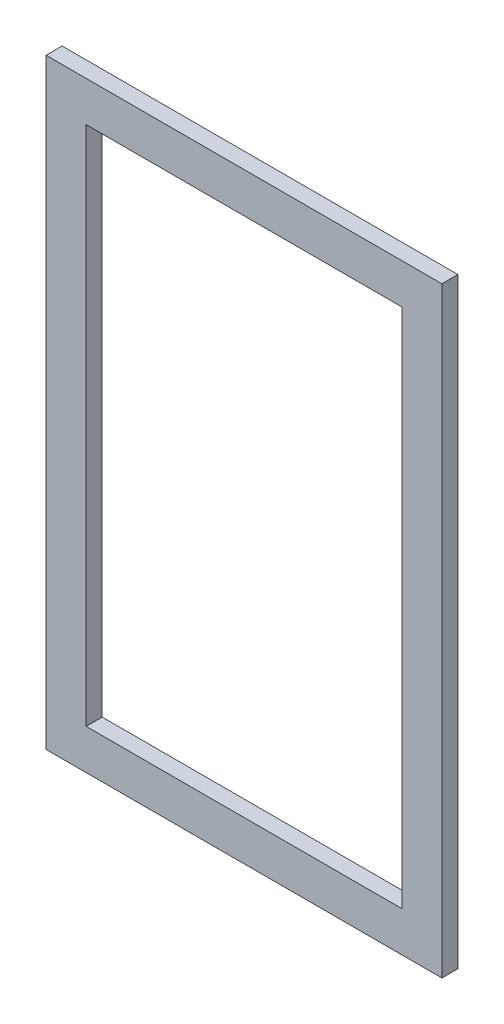
ISO-10303-21;
HEADER;
FILE_DESCRIPTION(('STEP AP214'),'2;1');
FILE_NAME('part.step','',(''),(''),'','','');
FILE_SCHEMA(('AUTOMOTIVE_DESIGN { 1 0 10303 214 1 1 1 1 }'));
ENDSEC;
DATA;
#1=APPLICATION_CONTEXT('core data for automotive mechanical design processes');
#2=APPLICATION_PROTOCOL_DEFINITION('international standard','automotive_design',2000,#1);
#3=PRODUCT_CONTEXT('',#1,'mechanical');
#4=PRODUCT('Part','Part','',(#3));
#5=PRODUCT_RELATED_PRODUCT_CATEGORY('part','',(#4));
#6=PRODUCT_DEFINITION_FORMATION('','',#4);
#7=PRODUCT_DEFINITION_CONTEXT('part definition',#1,'design');
#8=PRODUCT_DEFINITION('design','',#6,#7);
#9=PRODUCT_DEFINITION_SHAPE('','',#8);
#10=(LENGTH_UNIT() NAMED_UNIT(*) SI_UNIT(.MILLI.,.METRE.));
#11=(NAMED_UNIT(*) PLANE_ANGLE_UNIT() SI_UNIT($,.RADIAN.));
#12=(NAMED_UNIT(*) SI_UNIT($,.STERADIAN.) SOLID_ANGLE_UNIT());
#13=UNCERTAINTY_MEASURE_WITH_UNIT(LENGTH_MEASURE(1.E-05),#10,'distance_accuracy_value','');
#14=(GEOMETRIC_REPRESENTATION_CONTEXT(3) GLOBAL_UNCERTAINTY_ASSIGNED_CONTEXT((#13)) GLOBAL_UNIT_ASSIGNED_CONTEXT((#10,
#11,#12)) REPRESENTATION_CONTEXT('',''));
#15=CARTESIAN_POINT('',(0.,0.,0.));
#16=DIRECTION('',(0.,0.,1.));
#17=DIRECTION('',(1.,0.,0.));
#18=AXIS2_PLACEMENT_3D('',#15,#16,#17);
#19=CARTESIAN_POINT('',(-335.008892233003,-208.54308280627,334.460719179294));
#20=DIRECTION('',(1.,0.,0.));
#21=DIRECTION('',(0.,0.,-1.));
#22=AXIS2_PLACEMENT_3D('',#19,#20,#21);
#23=PLANE('',#22);
#24=DIRECTION('',(0.,-1.,0.));
#25=VECTOR('',#24,1.);
#26=CARTESIAN_POINT('',(-335.008892233003,-208.54308280627,318.460719179294));
#27=LINE('',#26,#25);
#28=CARTESIAN_POINT('',(-335.008892233003,391.45691719373,318.460719179294));
#29=VERTEX_POINT('',#28);
#30=CARTESIAN_POINT('',(-335.008892233003,-208.54308280627,318.460719179294));
#31=VERTEX_POINT('',#30);
#32=EDGE_CURVE('E130',#29,#31,#27,.T.);
#33=ORIENTED_EDGE('',*,*,#32,.T.);
#34=DIRECTION('',(0.,0.,-1.));
#35=VECTOR('',#34,1.);
#36=CARTESIAN_POINT('',(-335.008892233003,-208.54308280627,334.460719179294));
#37=LINE('',#36,#35);
#38=CARTESIAN_POINT('',(-335.008892233003,-208.54308280627,334.460719179294));
#39=VERTEX_POINT('',#38);
#40=EDGE_CURVE('E11',#39,#31,#37,.T.);
#41=ORIENTED_EDGE('',*,*,#40,.F.);
#42=DIRECTION('',(0.,-1.,0.));
#43=VECTOR('',#42,1.);
#44=CARTESIAN_POINT('',(-335.008892233003,-208.54308280627,334.460719179294));
#45=LINE('',#44,#43);
#46=CARTESIAN_POINT('',(-335.008892233003,391.45691719373,334.460719179294));
#47=VERTEX_POINT('',#46);
#48=EDGE_CURVE('E134',#47,#39,#45,.T.);
#49=ORIENTED_EDGE('',*,*,#48,.F.);
#50=DIRECTION('',(0.,0.,-1.));
#51=VECTOR('',#50,1.);
#52=CARTESIAN_POINT('',(-335.008892233003,391.45691719373,334.460719179294));
#53=LINE('',#52,#51);
#54=EDGE_CURVE('E144',#47,#29,#53,.T.);
#55=ORIENTED_EDGE('',*,*,#54,.T.);
#56=EDGE_LOOP('',(#33,#41,#49,#55));
#57=FACE_BOUND('',#56,.T.);
#58=ADVANCED_FACE('F33',(#57),#23,.F.);
#59=CARTESIAN_POINT('',(-335.008892233003,-208.54308280627,334.460719179294));
#60=DIRECTION('',(0.,1.,0.));
#61=DIRECTION('',(0.,0.,1.));
#62=AXIS2_PLACEMENT_3D('',#59,#60,#61);
#63=PLANE('',#62);
#64=DIRECTION('',(1.,0.,0.));
#65=VECTOR('',#64,1.);
#66=CARTESIAN_POINT('',(-335.008892233003,-208.54308280627,318.460719179294));
#67=LINE('',#66,#65);
#68=CARTESIAN_POINT('',(59.9911077669972,-208.54308280627,318.460719179294));
#69=VERTEX_POINT('',#68);
#70=EDGE_CURVE('E147',#31,#69,#67,.T.);
#71=ORIENTED_EDGE('',*,*,#70,.T.);
#72=DIRECTION('',(0.,0.,-1.));
#73=VECTOR('',#72,1.);
#74=CARTESIAN_POINT('',(59.9911077669972,-208.54308280627,334.460719179294));
#75=LINE('',#74,#73);
#76=CARTESIAN_POINT('',(59.9911077669972,-208.54308280627,334.460719179294));
#77=VERTEX_POINT('',#76);
#78=EDGE_CURVE('E40',#77,#69,#75,.T.);
#79=ORIENTED_EDGE('',*,*,#78,.F.);
#80=DIRECTION('',(1.,0.,0.));
#81=VECTOR('',#80,1.);
#82=CARTESIAN_POINT('',(-335.008892233003,-208.54308280627,334.460719179294));
#83=LINE('',#82,#81);
#84=EDGE_CURVE('E137',#39,#77,#83,.T.);
#85=ORIENTED_EDGE('',*,*,#84,.F.);
#86=ORIENTED_EDGE('',*,*,#40,.T.);
#87=EDGE_LOOP('',(#71,#79,#85,#86));
#88=FACE_BOUND('',#87,.T.);
#89=ADVANCED_FACE('F175',(#88),#63,.F.);
#90=CARTESIAN_POINT('',(59.9911077669972,-208.54308280627,334.460719179294));
#91=DIRECTION('',(-1.,0.,0.));
#92=DIRECTION('',(0.,0.,1.));
#93=AXIS2_PLACEMENT_3D('',#90,#91,#92);
#94=PLANE('',#93);
#95=DIRECTION('',(0.,1.,0.));
#96=VECTOR('',#95,1.);
#97=CARTESIAN_POINT('',(59.9911077669972,-208.54308280627,318.460719179294));
#98=LINE('',#97,#96);
#99=CARTESIAN_POINT('',(59.9911077669972,391.45691719373,318.460719179294));
#100=VERTEX_POINT('',#99);
#101=EDGE_CURVE('E149',#69,#100,#98,.T.);
#102=ORIENTED_EDGE('',*,*,#101,.T.);
#103=DIRECTION('',(0.,0.,-1.));
#104=VECTOR('',#103,1.);
#105=CARTESIAN_POINT('',(59.9911077669972,391.45691719373,334.460719179294));
#106=LINE('',#105,#104);
#107=CARTESIAN_POINT('',(59.9911077669972,391.45691719373,334.460719179294));
#108=VERTEX_POINT('',#107);
#109=EDGE_CURVE('E154',#108,#100,#106,.T.);
#110=ORIENTED_EDGE('',*,*,#109,.F.);
#111=DIRECTION('',(0.,1.,0.));
#112=VECTOR('',#111,1.);
#113=CARTESIAN_POINT('',(59.9911077669972,-208.54308280627,334.460719179294));
#114=LINE('',#113,#112);
#115=EDGE_CURVE('E140',#77,#108,#114,.T.);
#116=ORIENTED_EDGE('',*,*,#115,.F.);
#117=ORIENTED_EDGE('',*,*,#78,.T.);
#118=EDGE_LOOP('',(#102,#110,#116,#117));
#119=FACE_BOUND('',#118,.T.);
#120=ADVANCED_FACE('F161',(#119),#94,.F.);
#121=CARTESIAN_POINT('',(-335.008892233003,391.45691719373,334.460719179294));
#122=DIRECTION('',(0.,-1.,0.));
#123=DIRECTION('',(0.,0.,-1.));
#124=AXIS2_PLACEMENT_3D('',#121,#122,#123);
#125=PLANE('',#124);
#126=DIRECTION('',(-1.,0.,0.));
#127=VECTOR('',#126,1.);
#128=CARTESIAN_POINT('',(-335.008892233003,391.45691719373,318.460719179294));
#129=LINE('',#128,#127);
#130=EDGE_CURVE('E138',#100,#29,#129,.T.);
#131=ORIENTED_EDGE('',*,*,#130,.T.);
#132=ORIENTED_EDGE('',*,*,#54,.F.);
#133=DIRECTION('',(-1.,0.,0.));
#134=VECTOR('',#133,1.);
#135=CARTESIAN_POINT('',(-335.008892233003,391.45691719373,334.460719179294));
#136=LINE('',#135,#134);
#137=EDGE_CURVE('E142',#108,#47,#136,.T.);
#138=ORIENTED_EDGE('',*,*,#137,.F.);
#139=ORIENTED_EDGE('',*,*,#109,.T.);
#140=EDGE_LOOP('',(#131,#132,#138,#139));
#141=FACE_BOUND('',#140,.T.);
#142=ADVANCED_FACE('F168',(#141),#125,.F.);
#143=CARTESIAN_POINT('',(-335.008892233003,-208.54308280627,334.460719179294));
#144=DIRECTION('',(0.,0.,-1.));
#145=DIRECTION('',(-1.,0.,0.));
#146=AXIS2_PLACEMENT_3D('',#143,#144,#145);
#147=PLANE('',#146);
#148=DIRECTION('',(1.,0.,0.));
#149=VECTOR('',#148,1.);
#150=CARTESIAN_POINT('',(-295.008892233003,-168.54308280627,334.460719179294));
#151=LINE('',#150,#149);
#152=CARTESIAN_POINT('',(-295.008892233003,-168.54308280627,334.460719179294));
#153=VERTEX_POINT('',#152);
#154=CARTESIAN_POINT('',(19.9911077669974,-168.54308280627,334.460719179294));
#155=VERTEX_POINT('',#154);
#156=EDGE_CURVE('E124',#153,#155,#151,.T.);
#157=ORIENTED_EDGE('',*,*,#156,.F.);
#158=DIRECTION('',(0.,-1.,0.));
#159=VECTOR('',#158,1.);
#160=CARTESIAN_POINT('',(-295.008892233003,351.45691719373,334.460719179294));
#161=LINE('',#160,#159);
#162=CARTESIAN_POINT('',(-295.008892233003,351.45691719373,334.460719179294));
#163=VERTEX_POINT('',#162);
#164=EDGE_CURVE('E47',#163,#153,#161,.T.);
#165=ORIENTED_EDGE('',*,*,#164,.F.);
#166=DIRECTION('',(-1.,0.,0.));
#167=VECTOR('',#166,1.);
#168=CARTESIAN_POINT('',(-295.008892233003,351.45691719373,334.460719179294));
#169=LINE('',#168,#167);
#170=CARTESIAN_POINT('',(19.9911077669973,351.45691719373,334.460719179294));
#171=VERTEX_POINT('',#170);
#172=EDGE_CURVE('E115',#171,#163,#169,.T.);
#173=ORIENTED_EDGE('',*,*,#172,.F.);
#174=DIRECTION('',(0.,1.,0.));
#175=VECTOR('',#174,1.);
#176=CARTESIAN_POINT('',(19.9911077669973,351.45691719373,334.460719179294));
#177=LINE('',#176,#175);
#178=EDGE_CURVE('E118',#155,#171,#177,.T.);
#179=ORIENTED_EDGE('',*,*,#178,.F.);
#180=EDGE_LOOP('',(#157,#165,#173,#179));
#181=FACE_BOUND('',#180,.T.);
#182=ORIENTED_EDGE('',*,*,#48,.T.);
#183=ORIENTED_EDGE('',*,*,#84,.T.);
#184=ORIENTED_EDGE('',*,*,#115,.T.);
#185=ORIENTED_EDGE('',*,*,#137,.T.);
#186=EDGE_LOOP('',(#182,#183,#184,#185));
#187=FACE_BOUND('',#186,.T.);
#188=ADVANCED_FACE('F174',(#181,#187),#147,.F.);
#189=CARTESIAN_POINT('',(-335.008892233003,-208.54308280627,318.460719179294));
#190=DIRECTION('',(0.,0.,-1.));
#191=DIRECTION('',(-1.,0.,0.));
#192=AXIS2_PLACEMENT_3D('',#189,#190,#191);
#193=PLANE('',#192);
#194=DIRECTION('',(0.,-1.,0.));
#195=VECTOR('',#194,1.);
#196=CARTESIAN_POINT('',(-295.008892233003,351.45691719373,318.460719179294));
#197=LINE('',#196,#195);
#198=CARTESIAN_POINT('',(-295.008892233003,351.45691719373,318.460719179294));
#199=VERTEX_POINT('',#198);
#200=CARTESIAN_POINT('',(-295.008892233003,-168.54308280627,318.460719179294));
#201=VERTEX_POINT('',#200);
#202=EDGE_CURVE('E99',#199,#201,#197,.T.);
#203=ORIENTED_EDGE('',*,*,#202,.T.);
#204=DIRECTION('',(1.,0.,0.));
#205=VECTOR('',#204,1.);
#206=CARTESIAN_POINT('',(-295.008892233003,-168.54308280627,318.460719179294));
#207=LINE('',#206,#205);
#208=CARTESIAN_POINT('',(19.9911077669974,-168.54308280627,318.460719179294));
#209=VERTEX_POINT('',#208);
#210=EDGE_CURVE('E108',#201,#209,#207,.T.);
#211=ORIENTED_EDGE('',*,*,#210,.T.);
#212=DIRECTION('',(0.,1.,0.));
#213=VECTOR('',#212,1.);
#214=CARTESIAN_POINT('',(19.9911077669973,351.45691719373,318.460719179294));
#215=LINE('',#214,#213);
#216=CARTESIAN_POINT('',(19.9911077669973,351.45691719373,318.460719179294));
#217=VERTEX_POINT('',#216);
#218=EDGE_CURVE('E55',#209,#217,#215,.T.);
#219=ORIENTED_EDGE('',*,*,#218,.T.);
#220=DIRECTION('',(-1.,0.,0.));
#221=VECTOR('',#220,1.);
#222=CARTESIAN_POINT('',(-295.008892233003,351.45691719373,318.460719179294));
#223=LINE('',#222,#221);
#224=EDGE_CURVE('E105',#217,#199,#223,.T.);
#225=ORIENTED_EDGE('',*,*,#224,.T.);
#226=EDGE_LOOP('',(#203,#211,#219,#225));
#227=FACE_BOUND('',#226,.T.);
#228=ORIENTED_EDGE('',*,*,#32,.F.);
#229=ORIENTED_EDGE('',*,*,#130,.F.);
#230=ORIENTED_EDGE('',*,*,#101,.F.);
#231=ORIENTED_EDGE('',*,*,#70,.F.);
#232=EDGE_LOOP('',(#228,#229,#230,#231));
#233=FACE_BOUND('',#232,.T.);
#234=ADVANCED_FACE('F112',(#227,#233),#193,.T.);
#235=CARTESIAN_POINT('',(-295.008892233003,351.45691719373,318.460719179294));
#236=DIRECTION('',(-1.,0.,0.));
#237=DIRECTION('',(0.,-1.,0.));
#238=AXIS2_PLACEMENT_3D('',#235,#236,#237);
#239=PLANE('',#238);
#240=ORIENTED_EDGE('',*,*,#164,.T.);
#241=DIRECTION('',(0.,0.,1.));
#242=VECTOR('',#241,1.);
#243=CARTESIAN_POINT('',(-295.008892233003,-168.54308280627,318.460719179294));
#244=LINE('',#243,#242);
#245=EDGE_CURVE('E95',#201,#153,#244,.T.);
#246=ORIENTED_EDGE('',*,*,#245,.F.);
#247=ORIENTED_EDGE('',*,*,#202,.F.);
#248=DIRECTION('',(0.,0.,1.));
#249=VECTOR('',#248,1.);
#250=CARTESIAN_POINT('',(-295.008892233003,351.45691719373,318.460719179294));
#251=LINE('',#250,#249);
#252=EDGE_CURVE('E128',#199,#163,#251,.T.);
#253=ORIENTED_EDGE('',*,*,#252,.T.);
#254=EDGE_LOOP('',(#240,#246,#247,#253));
#255=FACE_BOUND('',#254,.T.);
#256=ADVANCED_FACE('F97',(#255),#239,.F.);
#257=CARTESIAN_POINT('',(-295.008892233003,351.45691719373,318.460719179294));
#258=DIRECTION('',(0.,1.,0.));
#259=DIRECTION('',(-1.,0.,0.));
#260=AXIS2_PLACEMENT_3D('',#257,#258,#259);
#261=PLANE('',#260);
#262=ORIENTED_EDGE('',*,*,#172,.T.);
#263=ORIENTED_EDGE('',*,*,#252,.F.);
#264=ORIENTED_EDGE('',*,*,#224,.F.);
#265=DIRECTION('',(0.,0.,1.));
#266=VECTOR('',#265,1.);
#267=CARTESIAN_POINT('',(19.9911077669973,351.45691719373,318.460719179294));
#268=LINE('',#267,#266);
#269=EDGE_CURVE('E131',#217,#171,#268,.T.);
#270=ORIENTED_EDGE('',*,*,#269,.T.);
#271=EDGE_LOOP('',(#262,#263,#264,#270));
#272=FACE_BOUND('',#271,.T.);
#273=ADVANCED_FACE('F192',(#272),#261,.F.);
#274=CARTESIAN_POINT('',(19.9911077669973,351.45691719373,318.460719179294));
#275=DIRECTION('',(1.,0.,0.));
#276=DIRECTION('',(0.,1.,0.));
#277=AXIS2_PLACEMENT_3D('',#274,#275,#276);
#278=PLANE('',#277);
#279=ORIENTED_EDGE('',*,*,#178,.T.);
#280=ORIENTED_EDGE('',*,*,#269,.F.);
#281=ORIENTED_EDGE('',*,*,#218,.F.);
#282=DIRECTION('',(0.,0.,1.));
#283=VECTOR('',#282,1.);
#284=CARTESIAN_POINT('',(19.9911077669974,-168.54308280627,318.460719179294));
#285=LINE('',#284,#283);
#286=EDGE_CURVE('E104',#209,#155,#285,.T.);
#287=ORIENTED_EDGE('',*,*,#286,.T.);
#288=EDGE_LOOP('',(#279,#280,#281,#287));
#289=FACE_BOUND('',#288,.T.);
#290=ADVANCED_FACE('F195',(#289),#278,.F.);
#291=CARTESIAN_POINT('',(-295.008892233003,-168.54308280627,318.460719179294));
#292=DIRECTION('',(0.,-1.,0.));
#293=DIRECTION('',(1.,0.,0.));
#294=AXIS2_PLACEMENT_3D('',#291,#292,#293);
#295=PLANE('',#294);
#296=ORIENTED_EDGE('',*,*,#156,.T.);
#297=ORIENTED_EDGE('',*,*,#286,.F.);
#298=ORIENTED_EDGE('',*,*,#210,.F.);
#299=ORIENTED_EDGE('',*,*,#245,.T.);
#300=EDGE_LOOP('',(#296,#297,#298,#299));
#301=FACE_BOUND('',#300,.T.);
#302=ADVANCED_FACE('F109',(#301),#295,.F.);
#303=CLOSED_SHELL('',(#58,#89,#120,#142,#188,#234,#256,#273,#290,#302));
#304=MANIFOLD_SOLID_BREP('B2',#303);
#305=ADVANCED_BREP_SHAPE_REPRESENTATION('',(#18,#304),#14);
#306=SHAPE_DEFINITION_REPRESENTATION(#9,#305);
ENDSEC;
END-ISO-10303-21;
